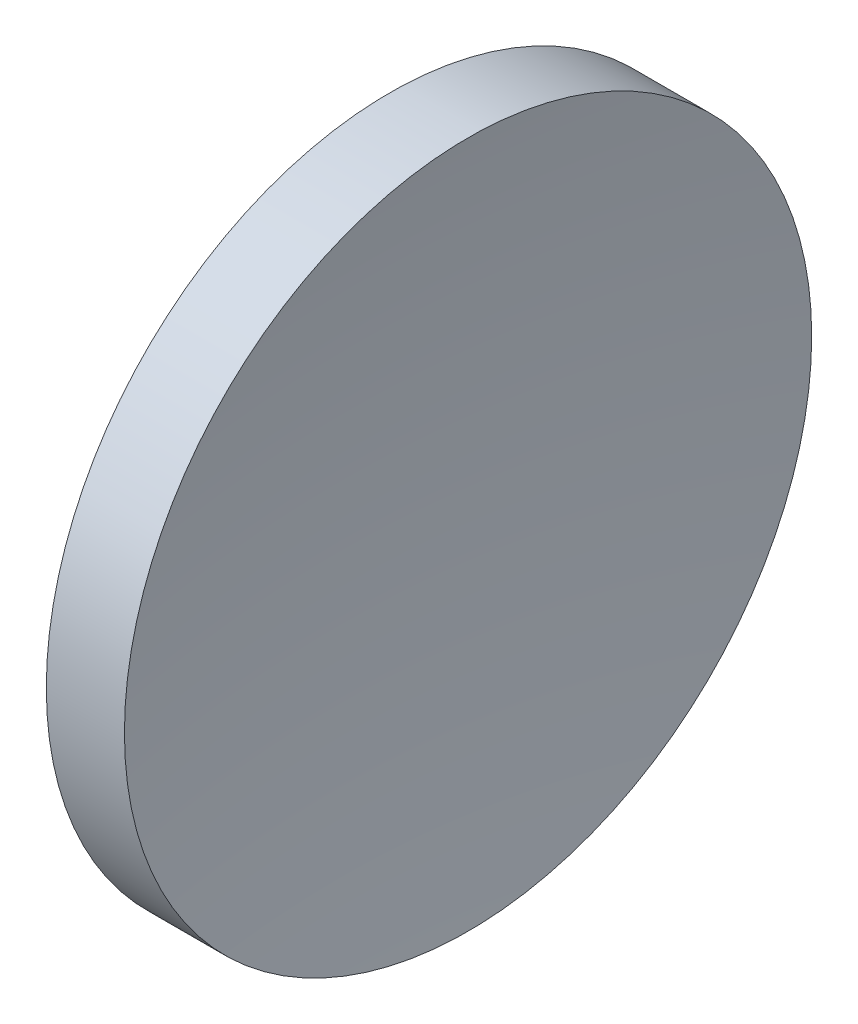
ISO-10303-21;
HEADER;
FILE_DESCRIPTION(('STEP AP214'),'2;1');
FILE_NAME('part.step','',(''),(''),'','','');
FILE_SCHEMA(('AUTOMOTIVE_DESIGN { 1 0 10303 214 1 1 1 1 }'));
ENDSEC;
DATA;
#1=APPLICATION_CONTEXT('core data for automotive mechanical design processes');
#2=APPLICATION_PROTOCOL_DEFINITION('international standard','automotive_design',2000,#1);
#3=PRODUCT_CONTEXT('',#1,'mechanical');
#4=PRODUCT('Part','Part','',(#3));
#5=PRODUCT_RELATED_PRODUCT_CATEGORY('part','',(#4));
#6=PRODUCT_DEFINITION_FORMATION('','',#4);
#7=PRODUCT_DEFINITION_CONTEXT('part definition',#1,'design');
#8=PRODUCT_DEFINITION('design','',#6,#7);
#9=PRODUCT_DEFINITION_SHAPE('','',#8);
#10=(LENGTH_UNIT() NAMED_UNIT(*) SI_UNIT(.MILLI.,.METRE.));
#11=(NAMED_UNIT(*) PLANE_ANGLE_UNIT() SI_UNIT($,.RADIAN.));
#12=(NAMED_UNIT(*) SI_UNIT($,.STERADIAN.) SOLID_ANGLE_UNIT());
#13=UNCERTAINTY_MEASURE_WITH_UNIT(LENGTH_MEASURE(1.E-05),#10,'distance_accuracy_value','');
#14=(GEOMETRIC_REPRESENTATION_CONTEXT(3) GLOBAL_UNCERTAINTY_ASSIGNED_CONTEXT((#13)) GLOBAL_UNIT_ASSIGNED_CONTEXT((#10,
#11,#12)) REPRESENTATION_CONTEXT('',''));
#15=CARTESIAN_POINT('',(0.,0.,0.));
#16=DIRECTION('',(0.,0.,1.));
#17=DIRECTION('',(1.,0.,0.));
#18=AXIS2_PLACEMENT_3D('',#15,#16,#17);
#19=CARTESIAN_POINT('',(213.062927436149,71.1939890865937,-0.0248086575627832));
#20=DIRECTION('',(0.,-1.,0.));
#21=DIRECTION('',(0.,0.,1.));
#22=AXIS2_PLACEMENT_3D('',#19,#20,#21);
#23=CIRCLE('',#22,91.7);
#24=TRIMMED_CURVE('',#23,(PARAMETER_VALUE(-1.57052578526965)),
(PARAMETER_VALUE(1.57052578526965)),.T.,.PARAMETER.);
#25=CARTESIAN_POINT('',(213.062927436149,71.1939890865937,0.));
#26=DIRECTION('',(-1.,0.,0.));
#27=AXIS1_PLACEMENT('',#25,#26);
#28=SURFACE_OF_REVOLUTION('',#24,#27);
#29=CARTESIAN_POINT('',(122.250102104985,71.1939890865937,0.));
#30=DIRECTION('',(-1.,0.,0.));
#31=DIRECTION('',(0.,0.,1.));
#32=AXIS2_PLACEMENT_3D('',#29,#30,#31);
#33=CIRCLE('',#32,12.7);
#34=CARTESIAN_POINT('',(122.250102104985,71.1939890865937,12.7));
#35=VERTEX_POINT('',#34);
#36=EDGE_CURVE('E11',#35,#35,#33,.T.);
#37=ORIENTED_EDGE('',*,*,#36,.F.);
#38=EDGE_LOOP('',(#37));
#39=FACE_BOUND('',#38,.T.);
#40=CARTESIAN_POINT('',(121.362930792035,71.1939890865937,0.));
#41=VERTEX_POINT('',#40);
#42=VERTEX_LOOP('',#41);
#43=FACE_BOUND('',#42,.T.);
#44=ADVANCED_FACE('F37',(#39,#43),#28,.F.);
#45=CARTESIAN_POINT('',(111.955229757561,71.1939890865937,0.));
#46=DIRECTION('',(-1.,0.,0.));
#47=DIRECTION('',(0.,0.,1.));
#48=AXIS2_PLACEMENT_3D('',#45,#46,#47);
#49=CYLINDRICAL_SURFACE('',#48,12.7);
#50=CARTESIAN_POINT('',(119.362930792035,71.1939890865937,0.));
#51=DIRECTION('',(-1.,0.,0.));
#52=DIRECTION('',(0.,0.,1.));
#53=AXIS2_PLACEMENT_3D('',#50,#51,#52);
#54=CIRCLE('',#53,12.7);
#55=CARTESIAN_POINT('',(119.362930792035,71.1939890865937,12.7));
#56=VERTEX_POINT('',#55);
#57=EDGE_CURVE('E43',#56,#56,#54,.T.);
#58=ORIENTED_EDGE('',*,*,#57,.F.);
#59=EDGE_LOOP('',(#58));
#60=FACE_BOUND('',#59,.T.);
#61=ORIENTED_EDGE('',*,*,#36,.T.);
#62=EDGE_LOOP('',(#61));
#63=FACE_BOUND('',#62,.T.);
#64=ADVANCED_FACE('F47',(#60,#63),#49,.T.);
#65=CARTESIAN_POINT('',(119.362930792035,71.1939890865937,0.));
#66=DIRECTION('',(1.,0.,0.));
#67=DIRECTION('',(0.,0.,-1.));
#68=AXIS2_PLACEMENT_3D('',#65,#66,#67);
#69=PLANE('',#68);
#70=ORIENTED_EDGE('',*,*,#57,.T.);
#71=EDGE_LOOP('',(#70));
#72=FACE_BOUND('',#71,.T.);
#73=ADVANCED_FACE('F52',(#72),#69,.F.);
#74=CLOSED_SHELL('',(#44,#64,#73));
#75=MANIFOLD_SOLID_BREP('B2',#74);
#76=ADVANCED_BREP_SHAPE_REPRESENTATION('',(#18,#75),#14);
#77=SHAPE_DEFINITION_REPRESENTATION(#9,#76);
ENDSEC;
END-ISO-10303-21;
